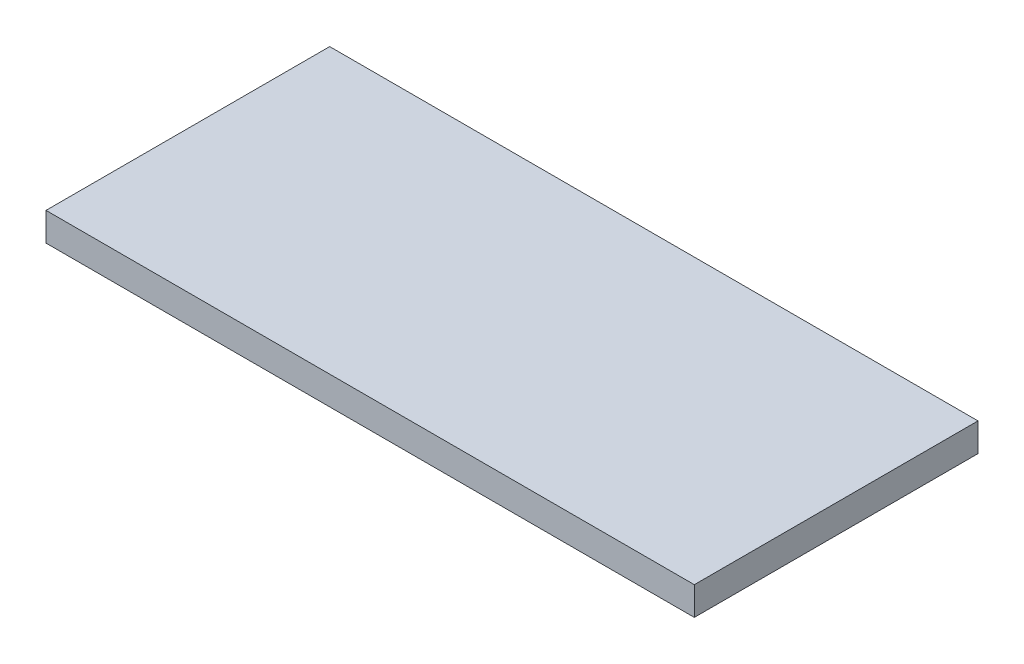
ISO-10303-21;
HEADER;
FILE_DESCRIPTION(('STEP AP214'),'2;1');
FILE_NAME('part.step','',(''),(''),'','','');
FILE_SCHEMA(('AUTOMOTIVE_DESIGN { 1 0 10303 214 1 1 1 1 }'));
ENDSEC;
DATA;
#1=APPLICATION_CONTEXT('core data for automotive mechanical design processes');
#2=APPLICATION_PROTOCOL_DEFINITION('international standard','automotive_design',2000,#1);
#3=PRODUCT_CONTEXT('',#1,'mechanical');
#4=PRODUCT('Part','Part','',(#3));
#5=PRODUCT_RELATED_PRODUCT_CATEGORY('part','',(#4));
#6=PRODUCT_DEFINITION_FORMATION('','',#4);
#7=PRODUCT_DEFINITION_CONTEXT('part definition',#1,'design');
#8=PRODUCT_DEFINITION('design','',#6,#7);
#9=PRODUCT_DEFINITION_SHAPE('','',#8);
#10=(LENGTH_UNIT() NAMED_UNIT(*) SI_UNIT(.MILLI.,.METRE.));
#11=(NAMED_UNIT(*) PLANE_ANGLE_UNIT() SI_UNIT($,.RADIAN.));
#12=(NAMED_UNIT(*) SI_UNIT($,.STERADIAN.) SOLID_ANGLE_UNIT());
#13=UNCERTAINTY_MEASURE_WITH_UNIT(LENGTH_MEASURE(1.E-05),#10,'distance_accuracy_value','');
#14=(GEOMETRIC_REPRESENTATION_CONTEXT(3) GLOBAL_UNCERTAINTY_ASSIGNED_CONTEXT((#13)) GLOBAL_UNIT_ASSIGNED_CONTEXT((#10,
#11,#12)) REPRESENTATION_CONTEXT('',''));
#15=CARTESIAN_POINT('',(0.,0.,0.));
#16=DIRECTION('',(0.,0.,1.));
#17=DIRECTION('',(1.,0.,0.));
#18=AXIS2_PLACEMENT_3D('',#15,#16,#17);
#19=CARTESIAN_POINT('',(-114.265,10.,-50.));
#20=DIRECTION('',(1.,0.,0.));
#21=DIRECTION('',(0.,0.,-1.));
#22=AXIS2_PLACEMENT_3D('',#19,#20,#21);
#23=PLANE('',#22);
#24=DIRECTION('',(0.,0.,1.));
#25=VECTOR('',#24,1.);
#26=CARTESIAN_POINT('',(-114.265,0.,-50.));
#27=LINE('',#26,#25);
#28=CARTESIAN_POINT('',(-114.265,0.,-50.));
#29=VERTEX_POINT('',#28);
#30=CARTESIAN_POINT('',(-114.265,0.,50.));
#31=VERTEX_POINT('',#30);
#32=EDGE_CURVE('E97',#29,#31,#27,.T.);
#33=ORIENTED_EDGE('',*,*,#32,.T.);
#34=DIRECTION('',(0.,-1.,0.));
#35=VECTOR('',#34,1.);
#36=CARTESIAN_POINT('',(-114.265,10.,50.));
#37=LINE('',#36,#35);
#38=CARTESIAN_POINT('',(-114.265,10.,50.));
#39=VERTEX_POINT('',#38);
#40=EDGE_CURVE('E11',#39,#31,#37,.T.);
#41=ORIENTED_EDGE('',*,*,#40,.F.);
#42=DIRECTION('',(0.,0.,1.));
#43=VECTOR('',#42,1.);
#44=CARTESIAN_POINT('',(-114.265,10.,-50.));
#45=LINE('',#44,#43);
#46=CARTESIAN_POINT('',(-114.265,10.,-50.));
#47=VERTEX_POINT('',#46);
#48=EDGE_CURVE('E85',#47,#39,#45,.T.);
#49=ORIENTED_EDGE('',*,*,#48,.F.);
#50=DIRECTION('',(0.,-1.,0.));
#51=VECTOR('',#50,1.);
#52=CARTESIAN_POINT('',(-114.265,10.,-50.));
#53=LINE('',#52,#51);
#54=EDGE_CURVE('E93',#47,#29,#53,.T.);
#55=ORIENTED_EDGE('',*,*,#54,.T.);
#56=EDGE_LOOP('',(#33,#41,#49,#55));
#57=FACE_BOUND('',#56,.T.);
#58=ADVANCED_FACE('F34',(#57),#23,.F.);
#59=CARTESIAN_POINT('',(-114.265,10.,50.));
#60=DIRECTION('',(0.,0.,-1.));
#61=DIRECTION('',(-1.,0.,0.));
#62=AXIS2_PLACEMENT_3D('',#59,#60,#61);
#63=PLANE('',#62);
#64=DIRECTION('',(1.,0.,0.));
#65=VECTOR('',#64,1.);
#66=CARTESIAN_POINT('',(-114.265,0.,50.));
#67=LINE('',#66,#65);
#68=CARTESIAN_POINT('',(114.265,0.,50.));
#69=VERTEX_POINT('',#68);
#70=EDGE_CURVE('E89',#31,#69,#67,.T.);
#71=ORIENTED_EDGE('',*,*,#70,.T.);
#72=DIRECTION('',(0.,-1.,0.));
#73=VECTOR('',#72,1.);
#74=CARTESIAN_POINT('',(114.265,10.,50.));
#75=LINE('',#74,#73);
#76=CARTESIAN_POINT('',(114.265,10.,50.));
#77=VERTEX_POINT('',#76);
#78=EDGE_CURVE('E42',#77,#69,#75,.T.);
#79=ORIENTED_EDGE('',*,*,#78,.F.);
#80=DIRECTION('',(1.,0.,0.));
#81=VECTOR('',#80,1.);
#82=CARTESIAN_POINT('',(-114.265,10.,50.));
#83=LINE('',#82,#81);
#84=EDGE_CURVE('E80',#39,#77,#83,.T.);
#85=ORIENTED_EDGE('',*,*,#84,.F.);
#86=ORIENTED_EDGE('',*,*,#40,.T.);
#87=EDGE_LOOP('',(#71,#79,#85,#86));
#88=FACE_BOUND('',#87,.T.);
#89=ADVANCED_FACE('F88',(#88),#63,.F.);
#90=CARTESIAN_POINT('',(114.265,10.,-50.));
#91=DIRECTION('',(-1.,0.,0.));
#92=DIRECTION('',(0.,0.,1.));
#93=AXIS2_PLACEMENT_3D('',#90,#91,#92);
#94=PLANE('',#93);
#95=DIRECTION('',(0.,0.,-1.));
#96=VECTOR('',#95,1.);
#97=CARTESIAN_POINT('',(114.265,0.,-50.));
#98=LINE('',#97,#96);
#99=CARTESIAN_POINT('',(114.265,0.,-50.));
#100=VERTEX_POINT('',#99);
#101=EDGE_CURVE('E67',#69,#100,#98,.T.);
#102=ORIENTED_EDGE('',*,*,#101,.T.);
#103=DIRECTION('',(0.,-1.,0.));
#104=VECTOR('',#103,1.);
#105=CARTESIAN_POINT('',(114.265,10.,-50.));
#106=LINE('',#105,#104);
#107=CARTESIAN_POINT('',(114.265,10.,-50.));
#108=VERTEX_POINT('',#107);
#109=EDGE_CURVE('E90',#108,#100,#106,.T.);
#110=ORIENTED_EDGE('',*,*,#109,.F.);
#111=DIRECTION('',(0.,0.,-1.));
#112=VECTOR('',#111,1.);
#113=CARTESIAN_POINT('',(114.265,10.,-50.));
#114=LINE('',#113,#112);
#115=EDGE_CURVE('E83',#77,#108,#114,.T.);
#116=ORIENTED_EDGE('',*,*,#115,.F.);
#117=ORIENTED_EDGE('',*,*,#78,.T.);
#118=EDGE_LOOP('',(#102,#110,#116,#117));
#119=FACE_BOUND('',#118,.T.);
#120=ADVANCED_FACE('F91',(#119),#94,.F.);
#121=CARTESIAN_POINT('',(-114.265,10.,-50.));
#122=DIRECTION('',(0.,0.,1.));
#123=DIRECTION('',(1.,0.,0.));
#124=AXIS2_PLACEMENT_3D('',#121,#122,#123);
#125=PLANE('',#124);
#126=DIRECTION('',(-1.,0.,0.));
#127=VECTOR('',#126,1.);
#128=CARTESIAN_POINT('',(-114.265,0.,-50.));
#129=LINE('',#128,#127);
#130=EDGE_CURVE('E73',#100,#29,#129,.T.);
#131=ORIENTED_EDGE('',*,*,#130,.T.);
#132=ORIENTED_EDGE('',*,*,#54,.F.);
#133=DIRECTION('',(-1.,0.,0.));
#134=VECTOR('',#133,1.);
#135=CARTESIAN_POINT('',(-114.265,10.,-50.));
#136=LINE('',#135,#134);
#137=EDGE_CURVE('E50',#108,#47,#136,.T.);
#138=ORIENTED_EDGE('',*,*,#137,.F.);
#139=ORIENTED_EDGE('',*,*,#109,.T.);
#140=EDGE_LOOP('',(#131,#132,#138,#139));
#141=FACE_BOUND('',#140,.T.);
#142=ADVANCED_FACE('F104',(#141),#125,.F.);
#143=CARTESIAN_POINT('',(0.,10.,0.));
#144=DIRECTION('',(0.,1.,0.));
#145=DIRECTION('',(0.,0.,1.));
#146=AXIS2_PLACEMENT_3D('',#143,#144,#145);
#147=PLANE('',#146);
#148=ORIENTED_EDGE('',*,*,#48,.T.);
#149=ORIENTED_EDGE('',*,*,#84,.T.);
#150=ORIENTED_EDGE('',*,*,#115,.T.);
#151=ORIENTED_EDGE('',*,*,#137,.T.);
#152=EDGE_LOOP('',(#148,#149,#150,#151));
#153=FACE_BOUND('',#152,.T.);
#154=ADVANCED_FACE('F81',(#153),#147,.T.);
#155=CARTESIAN_POINT('',(0.,0.,0.));
#156=DIRECTION('',(0.,1.,0.));
#157=DIRECTION('',(0.,0.,1.));
#158=AXIS2_PLACEMENT_3D('',#155,#156,#157);
#159=PLANE('',#158);
#160=ORIENTED_EDGE('',*,*,#32,.F.);
#161=ORIENTED_EDGE('',*,*,#130,.F.);
#162=ORIENTED_EDGE('',*,*,#101,.F.);
#163=ORIENTED_EDGE('',*,*,#70,.F.);
#164=EDGE_LOOP('',(#160,#161,#162,#163));
#165=FACE_BOUND('',#164,.T.);
#166=ADVANCED_FACE('F107',(#165),#159,.F.);
#167=CLOSED_SHELL('',(#58,#89,#120,#142,#154,#166));
#168=MANIFOLD_SOLID_BREP('B2',#167);
#169=ADVANCED_BREP_SHAPE_REPRESENTATION('',(#18,#168),#14);
#170=SHAPE_DEFINITION_REPRESENTATION(#9,#169);
ENDSEC;
END-ISO-10303-21;
